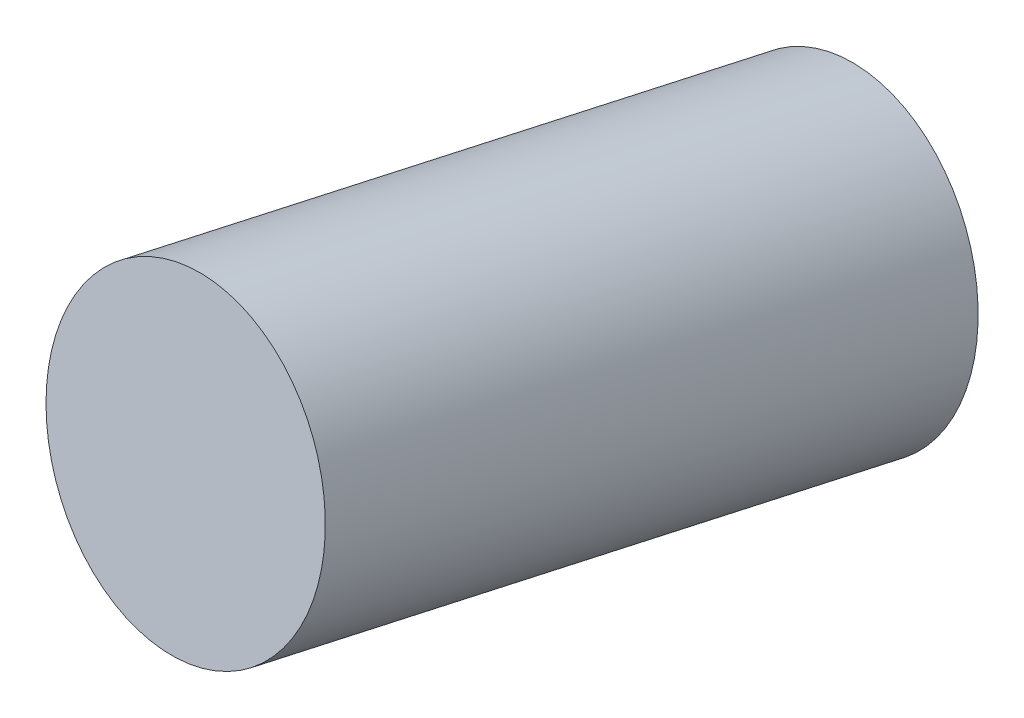
ISO-10303-21;
HEADER;
FILE_DESCRIPTION(('STEP AP214'),'2;1');
FILE_NAME('part.step','',(''),(''),'','','');
FILE_SCHEMA(('AUTOMOTIVE_DESIGN { 1 0 10303 214 1 1 1 1 }'));
ENDSEC;
DATA;
#1=APPLICATION_CONTEXT('core data for automotive mechanical design processes');
#2=APPLICATION_PROTOCOL_DEFINITION('international standard','automotive_design',2000,#1);
#3=PRODUCT_CONTEXT('',#1,'mechanical');
#4=PRODUCT('Part','Part','',(#3));
#5=PRODUCT_RELATED_PRODUCT_CATEGORY('part','',(#4));
#6=PRODUCT_DEFINITION_FORMATION('','',#4);
#7=PRODUCT_DEFINITION_CONTEXT('part definition',#1,'design');
#8=PRODUCT_DEFINITION('design','',#6,#7);
#9=PRODUCT_DEFINITION_SHAPE('','',#8);
#10=(LENGTH_UNIT() NAMED_UNIT(*) SI_UNIT(.MILLI.,.METRE.));
#11=(NAMED_UNIT(*) PLANE_ANGLE_UNIT() SI_UNIT($,.RADIAN.));
#12=(NAMED_UNIT(*) SI_UNIT($,.STERADIAN.) SOLID_ANGLE_UNIT());
#13=UNCERTAINTY_MEASURE_WITH_UNIT(LENGTH_MEASURE(1.E-05),#10,'distance_accuracy_value','');
#14=(GEOMETRIC_REPRESENTATION_CONTEXT(3) GLOBAL_UNCERTAINTY_ASSIGNED_CONTEXT((#13)) GLOBAL_UNIT_ASSIGNED_CONTEXT((#10,
#11,#12)) REPRESENTATION_CONTEXT('',''));
#15=CARTESIAN_POINT('',(0.,0.,0.));
#16=DIRECTION('',(0.,0.,1.));
#17=DIRECTION('',(1.,0.,0.));
#18=AXIS2_PLACEMENT_3D('',#15,#16,#17);
#19=CARTESIAN_POINT('',(7.18446700110872,-12.4438618712225,-2.83947693854923));
#20=DIRECTION('',(-0.0868240888334628,0.150383733180433,0.984807753012209));
#21=DIRECTION('',(-0.492403876506099,0.852868531952447,-0.173648177666927));
#22=AXIS2_PLACEMENT_3D('',#19,#20,#21);
#23=PLANE('',#22);
#24=CARTESIAN_POINT('',(6.23304408187462,-10.7959490356235,-3.175));
#25=DIRECTION('',(-0.0868240888334628,0.150383733180433,0.984807753012209));
#26=DIRECTION('',(-0.492403876506099,0.852868531952447,-0.173648177666927));
#27=AXIS2_PLACEMENT_3D('',#24,#25,#26);
#28=CIRCLE('',#27,1.93220030269668);
#29=CARTESIAN_POINT('',(5.28162116264052,-9.14803620002451,-3.51052306145076));
#30=VERTEX_POINT('',#29);
#31=EDGE_CURVE('E10',#30,#30,#28,.T.);
#32=ORIENTED_EDGE('',*,*,#31,.F.);
#33=EDGE_LOOP('',(#32));
#34=FACE_BOUND('',#33,.T.);
#35=ADVANCED_FACE('F15',(#34),#23,.F.);
#36=CARTESIAN_POINT('',(5.46326660671925,-9.46265533813228,5.55625000000001));
#37=DIRECTION('',(-0.0868240888334628,0.150383733180433,0.984807753012209));
#38=DIRECTION('',(-0.492403876506099,0.852868531952447,-0.173648177666927));
#39=AXIS2_PLACEMENT_3D('',#36,#37,#38);
#40=CYLINDRICAL_SURFACE('',#39,1.93220030269667);
#41=CARTESIAN_POINT('',(5.55784215191017,-9.62646498755648,4.48352085995661));
#42=DIRECTION('',(-0.0868240888334628,0.150383733180433,0.984807753012209));
#43=DIRECTION('',(-0.492403876506099,0.852868531952447,-0.173648177666927));
#44=AXIS2_PLACEMENT_3D('',#41,#42,#43);
#45=CIRCLE('',#44,1.93220030269667);
#46=CARTESIAN_POINT('',(4.60641923267607,-7.9785521519575,4.14799779850585));
#47=VERTEX_POINT('',#46);
#48=EDGE_CURVE('E19',#47,#47,#45,.T.);
#49=ORIENTED_EDGE('',*,*,#48,.F.);
#50=EDGE_LOOP('',(#49));
#51=FACE_BOUND('',#50,.T.);
#52=ORIENTED_EDGE('',*,*,#31,.T.);
#53=EDGE_LOOP('',(#52));
#54=FACE_BOUND('',#53,.T.);
#55=ADVANCED_FACE('F29',(#51,#54),#40,.T.);
#56=CARTESIAN_POINT('',(5.55784215191017,-9.62646498755648,4.48352085995661));
#57=DIRECTION('',(0.0868240888334628,-0.150383733180433,-0.984807753012209));
#58=DIRECTION('',(0.492403876506099,-0.852868531952447,0.173648177666927));
#59=AXIS2_PLACEMENT_3D('',#56,#57,#58);
#60=PLANE('',#59);
#61=ORIENTED_EDGE('',*,*,#48,.T.);
#62=EDGE_LOOP('',(#61));
#63=FACE_BOUND('',#62,.T.);
#64=ADVANCED_FACE('F17',(#63),#60,.F.);
#65=CLOSED_SHELL('',(#35,#55,#64));
#66=MANIFOLD_SOLID_BREP('B1',#65);
#67=ADVANCED_BREP_SHAPE_REPRESENTATION('',(#18,#66),#14);
#68=SHAPE_DEFINITION_REPRESENTATION(#9,#67);
ENDSEC;
END-ISO-10303-21;
